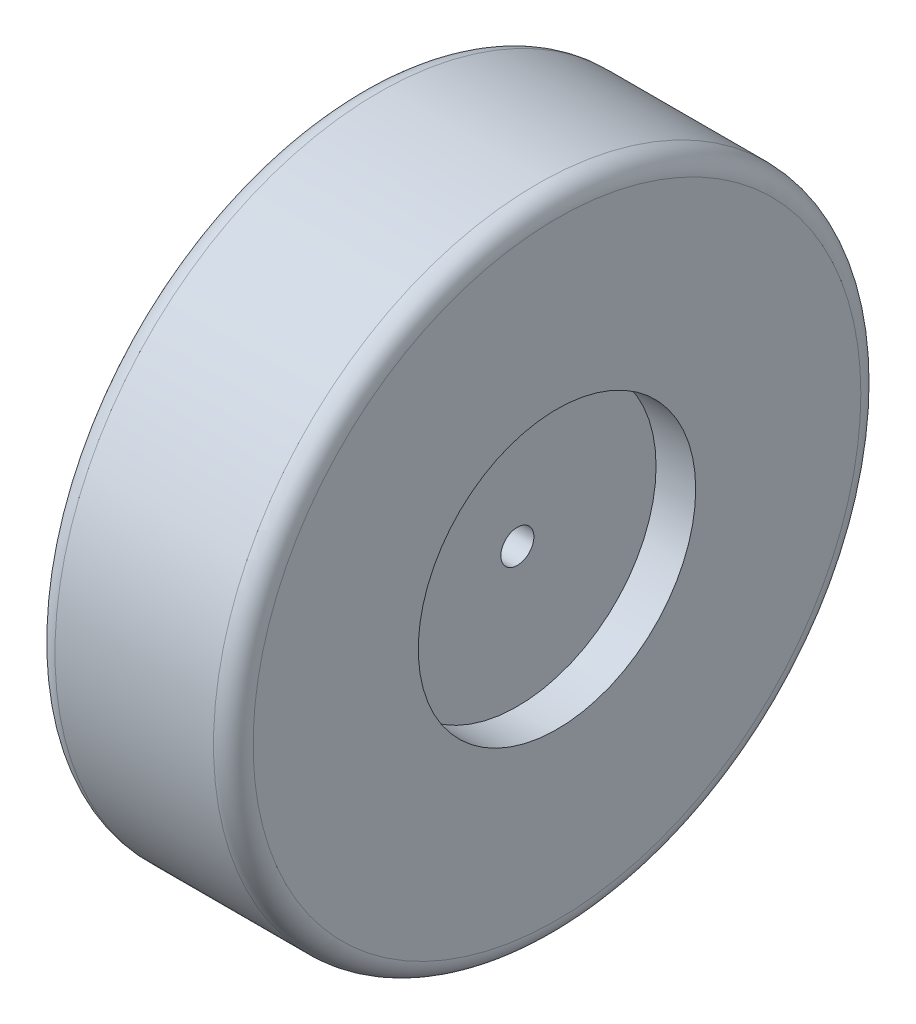
ISO-10303-21;
HEADER;
FILE_DESCRIPTION(('STEP AP214'),'2;1');
FILE_NAME('part.step','',(''),(''),'','','');
FILE_SCHEMA(('AUTOMOTIVE_DESIGN { 1 0 10303 214 1 1 1 1 }'));
ENDSEC;
DATA;
#1=APPLICATION_CONTEXT('core data for automotive mechanical design processes');
#2=APPLICATION_PROTOCOL_DEFINITION('international standard','automotive_design',2000,#1);
#3=PRODUCT_CONTEXT('',#1,'mechanical');
#4=PRODUCT('Part','Part','',(#3));
#5=PRODUCT_RELATED_PRODUCT_CATEGORY('part','',(#4));
#6=PRODUCT_DEFINITION_FORMATION('','',#4);
#7=PRODUCT_DEFINITION_CONTEXT('part definition',#1,'design');
#8=PRODUCT_DEFINITION('design','',#6,#7);
#9=PRODUCT_DEFINITION_SHAPE('','',#8);
#10=(LENGTH_UNIT() NAMED_UNIT(*) SI_UNIT(.MILLI.,.METRE.));
#11=(NAMED_UNIT(*) PLANE_ANGLE_UNIT() SI_UNIT($,.RADIAN.));
#12=(NAMED_UNIT(*) SI_UNIT($,.STERADIAN.) SOLID_ANGLE_UNIT());
#13=UNCERTAINTY_MEASURE_WITH_UNIT(LENGTH_MEASURE(1.E-05),#10,'distance_accuracy_value','');
#14=(GEOMETRIC_REPRESENTATION_CONTEXT(3) GLOBAL_UNCERTAINTY_ASSIGNED_CONTEXT((#13)) GLOBAL_UNIT_ASSIGNED_CONTEXT((#10,
#11,#12)) REPRESENTATION_CONTEXT('',''));
#15=CARTESIAN_POINT('',(0.,0.,0.));
#16=DIRECTION('',(0.,0.,1.));
#17=DIRECTION('',(1.,0.,0.));
#18=AXIS2_PLACEMENT_3D('',#15,#16,#17);
#19=CARTESIAN_POINT('',(30.,0.,0.));
#20=DIRECTION('',(-1.,0.,0.));
#21=DIRECTION('',(0.,0.,1.));
#22=AXIS2_PLACEMENT_3D('',#19,#20,#21);
#23=CYLINDRICAL_SURFACE('',#22,49.);
#24=CARTESIAN_POINT('',(3.,0.,0.));
#25=DIRECTION('',(1.,0.,0.));
#26=DIRECTION('',(0.,0.,-1.));
#27=AXIS2_PLACEMENT_3D('',#24,#25,#26);
#28=CIRCLE('',#27,49.);
#29=CARTESIAN_POINT('',(3.,0.,-49.));
#30=VERTEX_POINT('',#29);
#31=EDGE_CURVE('E44',#30,#30,#28,.T.);
#32=ORIENTED_EDGE('',*,*,#31,.T.);
#33=EDGE_LOOP('',(#32));
#34=FACE_BOUND('',#33,.T.);
#35=CARTESIAN_POINT('',(27.,0.,0.));
#36=DIRECTION('',(1.,0.,0.));
#37=DIRECTION('',(0.,0.,-1.));
#38=AXIS2_PLACEMENT_3D('',#35,#36,#37);
#39=CIRCLE('',#38,49.);
#40=CARTESIAN_POINT('',(27.,0.,-49.));
#41=VERTEX_POINT('',#40);
#42=EDGE_CURVE('E48',#41,#41,#39,.F.);
#43=ORIENTED_EDGE('',*,*,#42,.T.);
#44=EDGE_LOOP('',(#43));
#45=FACE_BOUND('',#44,.T.);
#46=ADVANCED_FACE('F33',(#34,#45),#23,.T.);
#47=CARTESIAN_POINT('',(30.,0.,0.));
#48=DIRECTION('',(1.,0.,0.));
#49=DIRECTION('',(0.,0.,-1.));
#50=AXIS2_PLACEMENT_3D('',#47,#48,#49);
#51=PLANE('',#50);
#52=CARTESIAN_POINT('',(30.,0.,0.));
#53=DIRECTION('',(1.,0.,0.));
#54=DIRECTION('',(0.,0.,-1.));
#55=AXIS2_PLACEMENT_3D('',#52,#53,#54);
#56=CIRCLE('',#55,21.);
#57=CARTESIAN_POINT('',(30.,0.,-21.));
#58=VERTEX_POINT('',#57);
#59=EDGE_CURVE('E54',#58,#58,#56,.T.);
#60=ORIENTED_EDGE('',*,*,#59,.F.);
#61=EDGE_LOOP('',(#60));
#62=FACE_BOUND('',#61,.T.);
#63=CARTESIAN_POINT('',(30.,0.,0.));
#64=DIRECTION('',(1.,0.,0.));
#65=DIRECTION('',(0.,0.,-1.));
#66=AXIS2_PLACEMENT_3D('',#63,#64,#65);
#67=CIRCLE('',#66,46.);
#68=CARTESIAN_POINT('',(30.,0.,-46.));
#69=VERTEX_POINT('',#68);
#70=EDGE_CURVE('E10',#69,#69,#67,.T.);
#71=ORIENTED_EDGE('',*,*,#70,.T.);
#72=EDGE_LOOP('',(#71));
#73=FACE_BOUND('',#72,.T.);
#74=ADVANCED_FACE('F86',(#62,#73),#51,.T.);
#75=CARTESIAN_POINT('',(0.,0.,0.));
#76=DIRECTION('',(1.,0.,0.));
#77=DIRECTION('',(0.,0.,-1.));
#78=AXIS2_PLACEMENT_3D('',#75,#76,#77);
#79=PLANE('',#78);
#80=CARTESIAN_POINT('',(0.,0.,0.));
#81=DIRECTION('',(1.,0.,0.));
#82=DIRECTION('',(0.,0.,-1.));
#83=AXIS2_PLACEMENT_3D('',#80,#81,#82);
#84=CIRCLE('',#83,46.);
#85=CARTESIAN_POINT('',(0.,0.,-46.));
#86=VERTEX_POINT('',#85);
#87=EDGE_CURVE('E40',#86,#86,#84,.F.);
#88=ORIENTED_EDGE('',*,*,#87,.T.);
#89=EDGE_LOOP('',(#88));
#90=FACE_BOUND('',#89,.T.);
#91=ADVANCED_FACE('F88',(#90),#79,.F.);
#92=CARTESIAN_POINT('',(3.,0.,0.));
#93=DIRECTION('',(1.,0.,0.));
#94=DIRECTION('',(0.,0.,-1.));
#95=AXIS2_PLACEMENT_3D('',#92,#93,#94);
#96=TOROIDAL_SURFACE('',#95,46.,3.);
#97=ORIENTED_EDGE('',*,*,#87,.F.);
#98=EDGE_LOOP('',(#97));
#99=FACE_BOUND('',#98,.T.);
#100=ORIENTED_EDGE('',*,*,#31,.F.);
#101=EDGE_LOOP('',(#100));
#102=FACE_BOUND('',#101,.T.);
#103=ADVANCED_FACE('F94',(#99,#102),#96,.T.);
#104=CARTESIAN_POINT('',(27.,0.,0.));
#105=DIRECTION('',(1.,0.,0.));
#106=DIRECTION('',(0.,0.,-1.));
#107=AXIS2_PLACEMENT_3D('',#104,#105,#106);
#108=TOROIDAL_SURFACE('',#107,46.,3.);
#109=ORIENTED_EDGE('',*,*,#42,.F.);
#110=EDGE_LOOP('',(#109));
#111=FACE_BOUND('',#110,.T.);
#112=ORIENTED_EDGE('',*,*,#70,.F.);
#113=EDGE_LOOP('',(#112));
#114=FACE_BOUND('',#113,.T.);
#115=ADVANCED_FACE('F35',(#111,#114),#108,.T.);
#116=CARTESIAN_POINT('',(24.,0.,0.));
#117=DIRECTION('',(1.,0.,0.));
#118=DIRECTION('',(0.,0.,-1.));
#119=AXIS2_PLACEMENT_3D('',#116,#117,#118);
#120=CYLINDRICAL_SURFACE('',#119,21.);
#121=CARTESIAN_POINT('',(24.,0.,0.));
#122=DIRECTION('',(1.,0.,0.));
#123=DIRECTION('',(0.,0.,-1.));
#124=AXIS2_PLACEMENT_3D('',#121,#122,#123);
#125=CIRCLE('',#124,21.);
#126=CARTESIAN_POINT('',(24.,0.,-21.));
#127=VERTEX_POINT('',#126);
#128=EDGE_CURVE('E53',#127,#127,#125,.T.);
#129=ORIENTED_EDGE('',*,*,#128,.F.);
#130=EDGE_LOOP('',(#129));
#131=FACE_BOUND('',#130,.T.);
#132=ORIENTED_EDGE('',*,*,#59,.T.);
#133=EDGE_LOOP('',(#132));
#134=FACE_BOUND('',#133,.T.);
#135=ADVANCED_FACE('F77',(#131,#134),#120,.F.);
#136=CARTESIAN_POINT('',(24.,0.,0.));
#137=DIRECTION('',(1.,0.,0.));
#138=DIRECTION('',(0.,0.,-1.));
#139=AXIS2_PLACEMENT_3D('',#136,#137,#138);
#140=PLANE('',#139);
#141=CARTESIAN_POINT('',(24.,0.,0.));
#142=DIRECTION('',(1.,0.,0.));
#143=DIRECTION('',(0.,0.,-1.));
#144=AXIS2_PLACEMENT_3D('',#141,#142,#143);
#145=CIRCLE('',#144,2.5);
#146=CARTESIAN_POINT('',(24.,0.,-2.5));
#147=VERTEX_POINT('',#146);
#148=EDGE_CURVE('E60',#147,#147,#145,.T.);
#149=ORIENTED_EDGE('',*,*,#148,.F.);
#150=EDGE_LOOP('',(#149));
#151=FACE_BOUND('',#150,.T.);
#152=ORIENTED_EDGE('',*,*,#128,.T.);
#153=EDGE_LOOP('',(#152));
#154=FACE_BOUND('',#153,.T.);
#155=ADVANCED_FACE('F71',(#151,#154),#140,.T.);
#156=CARTESIAN_POINT('',(18.,0.,0.));
#157=DIRECTION('',(1.,0.,0.));
#158=DIRECTION('',(0.,0.,-1.));
#159=AXIS2_PLACEMENT_3D('',#156,#157,#158);
#160=CYLINDRICAL_SURFACE('',#159,2.5);
#161=CARTESIAN_POINT('',(18.,0.,0.));
#162=DIRECTION('',(1.,0.,0.));
#163=DIRECTION('',(0.,0.,-1.));
#164=AXIS2_PLACEMENT_3D('',#161,#162,#163);
#165=CIRCLE('',#164,2.5);
#166=CARTESIAN_POINT('',(18.,0.,-2.5));
#167=VERTEX_POINT('',#166);
#168=EDGE_CURVE('E57',#167,#167,#165,.T.);
#169=ORIENTED_EDGE('',*,*,#168,.F.);
#170=EDGE_LOOP('',(#169));
#171=FACE_BOUND('',#170,.T.);
#172=ORIENTED_EDGE('',*,*,#148,.T.);
#173=EDGE_LOOP('',(#172));
#174=FACE_BOUND('',#173,.T.);
#175=ADVANCED_FACE('F68',(#171,#174),#160,.F.);
#176=CARTESIAN_POINT('',(18.,0.,0.));
#177=DIRECTION('',(1.,0.,0.));
#178=DIRECTION('',(0.,0.,-1.));
#179=AXIS2_PLACEMENT_3D('',#176,#177,#178);
#180=PLANE('',#179);
#181=ORIENTED_EDGE('',*,*,#168,.T.);
#182=EDGE_LOOP('',(#181));
#183=FACE_BOUND('',#182,.T.);
#184=ADVANCED_FACE('F66',(#183),#180,.T.);
#185=CLOSED_SHELL('',(#46,#74,#91,#103,#115,#135,#155,#175,#184));
#186=MANIFOLD_SOLID_BREP('B2',#185);
#187=ADVANCED_BREP_SHAPE_REPRESENTATION('',(#18,#186),#14);
#188=SHAPE_DEFINITION_REPRESENTATION(#9,#187);
ENDSEC;
END-ISO-10303-21;
